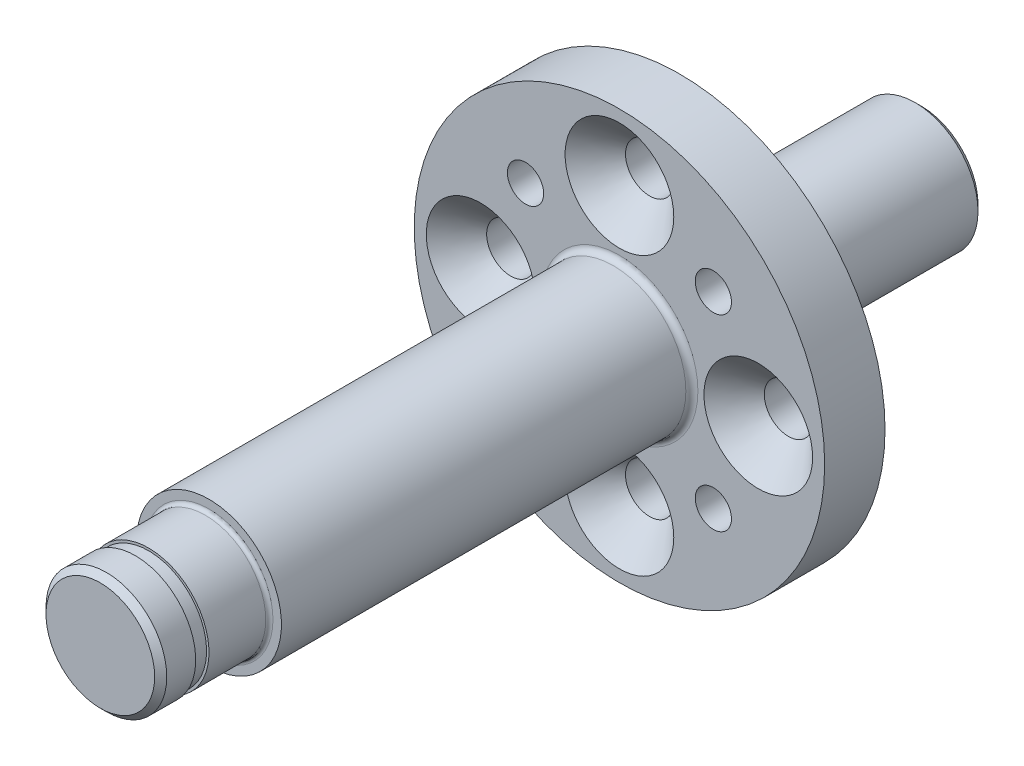
ISO-10303-21;
HEADER;
FILE_DESCRIPTION(('STEP AP214'),'2;1');
FILE_NAME('part.step','',(''),(''),'','','');
FILE_SCHEMA(('AUTOMOTIVE_DESIGN { 1 0 10303 214 1 1 1 1 }'));
ENDSEC;
DATA;
#1=APPLICATION_CONTEXT('core data for automotive mechanical design processes');
#2=APPLICATION_PROTOCOL_DEFINITION('international standard','automotive_design',2000,#1);
#3=PRODUCT_CONTEXT('',#1,'mechanical');
#4=PRODUCT('Part','Part','',(#3));
#5=PRODUCT_RELATED_PRODUCT_CATEGORY('part','',(#4));
#6=PRODUCT_DEFINITION_FORMATION('','',#4);
#7=PRODUCT_DEFINITION_CONTEXT('part definition',#1,'design');
#8=PRODUCT_DEFINITION('design','',#6,#7);
#9=PRODUCT_DEFINITION_SHAPE('','',#8);
#10=(LENGTH_UNIT() NAMED_UNIT(*) SI_UNIT(.MILLI.,.METRE.));
#11=(NAMED_UNIT(*) PLANE_ANGLE_UNIT() SI_UNIT($,.RADIAN.));
#12=(NAMED_UNIT(*) SI_UNIT($,.STERADIAN.) SOLID_ANGLE_UNIT());
#13=UNCERTAINTY_MEASURE_WITH_UNIT(LENGTH_MEASURE(1.E-05),#10,'distance_accuracy_value','');
#14=(GEOMETRIC_REPRESENTATION_CONTEXT(3) GLOBAL_UNCERTAINTY_ASSIGNED_CONTEXT((#13)) GLOBAL_UNIT_ASSIGNED_CONTEXT((#10,
#11,#12)) REPRESENTATION_CONTEXT('',''));
#15=CARTESIAN_POINT('',(0.,0.,0.));
#16=DIRECTION('',(0.,0.,1.));
#17=DIRECTION('',(1.,0.,0.));
#18=AXIS2_PLACEMENT_3D('',#15,#16,#17);
#19=CARTESIAN_POINT('',(0.,0.,5.));
#20=DIRECTION('',(0.,0.,-1.));
#21=DIRECTION('',(-1.,0.,0.));
#22=AXIS2_PLACEMENT_3D('',#19,#20,#21);
#23=CYLINDRICAL_SURFACE('',#22,17.);
#24=CARTESIAN_POINT('',(0.,0.,5.));
#25=DIRECTION('',(0.,0.,1.));
#26=DIRECTION('',(1.,0.,0.));
#27=AXIS2_PLACEMENT_3D('',#24,#25,#26);
#28=CIRCLE('',#27,17.);
#29=CARTESIAN_POINT('',(17.,0.,5.));
#30=VERTEX_POINT('',#29);
#31=EDGE_CURVE('E70',#30,#30,#28,.T.);
#32=ORIENTED_EDGE('',*,*,#31,.F.);
#33=EDGE_LOOP('',(#32));
#34=FACE_BOUND('',#33,.T.);
#35=CARTESIAN_POINT('',(0.,0.,0.));
#36=DIRECTION('',(0.,0.,1.));
#37=DIRECTION('',(1.,0.,0.));
#38=AXIS2_PLACEMENT_3D('',#35,#36,#37);
#39=CIRCLE('',#38,17.);
#40=CARTESIAN_POINT('',(17.,0.,0.));
#41=VERTEX_POINT('',#40);
#42=EDGE_CURVE('E89',#41,#41,#39,.T.);
#43=ORIENTED_EDGE('',*,*,#42,.T.);
#44=EDGE_LOOP('',(#43));
#45=FACE_BOUND('',#44,.T.);
#46=ADVANCED_FACE('F32',(#34,#45),#23,.T.);
#47=CARTESIAN_POINT('',(0.,0.,5.));
#48=DIRECTION('',(0.,0.,1.));
#49=DIRECTION('',(1.,0.,0.));
#50=AXIS2_PLACEMENT_3D('',#47,#48,#49);
#51=PLANE('',#50);
#52=CARTESIAN_POINT('',(0.,0.,5.));
#53=DIRECTION('',(0.,0.,1.));
#54=DIRECTION('',(1.,0.,0.));
#55=AXIS2_PLACEMENT_3D('',#52,#53,#54);
#56=CIRCLE('',#55,6.5);
#57=CARTESIAN_POINT('',(6.5,0.,5.));
#58=VERTEX_POINT('',#57);
#59=EDGE_CURVE('E39',#58,#58,#56,.F.);
#60=ORIENTED_EDGE('',*,*,#59,.T.);
#61=EDGE_LOOP('',(#60));
#62=FACE_BOUND('',#61,.T.);
#63=CARTESIAN_POINT('',(7.77817459305201,7.77817459305204,5.));
#64=DIRECTION('',(0.,0.,1.));
#65=DIRECTION('',(1.,0.,0.));
#66=AXIS2_PLACEMENT_3D('',#63,#64,#65);
#67=CIRCLE('',#66,1.5);
#68=CARTESIAN_POINT('',(9.278174593052,7.77817459305204,5.));
#69=VERTEX_POINT('',#68);
#70=EDGE_CURVE('E133',#69,#69,#67,.T.);
#71=ORIENTED_EDGE('',*,*,#70,.F.);
#72=EDGE_LOOP('',(#71));
#73=FACE_BOUND('',#72,.T.);
#74=CARTESIAN_POINT('',(-7.77817459305201,-7.77817459305203,5.));
#75=DIRECTION('',(0.,0.,1.));
#76=DIRECTION('',(1.,0.,0.));
#77=AXIS2_PLACEMENT_3D('',#74,#75,#76);
#78=CIRCLE('',#77,1.5);
#79=CARTESIAN_POINT('',(-6.27817459305201,-7.77817459305203,5.));
#80=VERTEX_POINT('',#79);
#81=EDGE_CURVE('E127',#80,#80,#78,.T.);
#82=ORIENTED_EDGE('',*,*,#81,.F.);
#83=EDGE_LOOP('',(#82));
#84=FACE_BOUND('',#83,.T.);
#85=CARTESIAN_POINT('',(-7.77817459305204,7.77817459305201,5.));
#86=DIRECTION('',(0.,0.,1.));
#87=DIRECTION('',(1.,0.,0.));
#88=AXIS2_PLACEMENT_3D('',#85,#86,#87);
#89=CIRCLE('',#88,1.5);
#90=CARTESIAN_POINT('',(-6.27817459305204,7.77817459305201,5.));
#91=VERTEX_POINT('',#90);
#92=EDGE_CURVE('E121',#91,#91,#89,.T.);
#93=ORIENTED_EDGE('',*,*,#92,.F.);
#94=EDGE_LOOP('',(#93));
#95=FACE_BOUND('',#94,.T.);
#96=CARTESIAN_POINT('',(7.77817459305204,-7.77817459305201,5.));
#97=DIRECTION('',(0.,0.,1.));
#98=DIRECTION('',(1.,0.,0.));
#99=AXIS2_PLACEMENT_3D('',#96,#97,#98);
#100=CIRCLE('',#99,1.5);
#101=CARTESIAN_POINT('',(9.27817459305203,-7.77817459305201,5.));
#102=VERTEX_POINT('',#101);
#103=EDGE_CURVE('E115',#102,#102,#100,.T.);
#104=ORIENTED_EDGE('',*,*,#103,.F.);
#105=EDGE_LOOP('',(#104));
#106=FACE_BOUND('',#105,.T.);
#107=CARTESIAN_POINT('',(0.,11.5,5.));
#108=DIRECTION('',(0.,0.,1.));
#109=DIRECTION('',(1.,0.,0.));
#110=AXIS2_PLACEMENT_3D('',#107,#108,#109);
#111=CIRCLE('',#110,4.5);
#112=CARTESIAN_POINT('',(4.5,11.5,5.));
#113=VERTEX_POINT('',#112);
#114=EDGE_CURVE('E109',#113,#113,#111,.T.);
#115=ORIENTED_EDGE('',*,*,#114,.F.);
#116=EDGE_LOOP('',(#115));
#117=FACE_BOUND('',#116,.T.);
#118=CARTESIAN_POINT('',(11.5,0.,5.));
#119=DIRECTION('',(0.,0.,1.));
#120=DIRECTION('',(1.,0.,0.));
#121=AXIS2_PLACEMENT_3D('',#118,#119,#120);
#122=CIRCLE('',#121,4.5);
#123=CARTESIAN_POINT('',(16.,0.,5.));
#124=VERTEX_POINT('',#123);
#125=EDGE_CURVE('E74',#124,#124,#122,.T.);
#126=ORIENTED_EDGE('',*,*,#125,.F.);
#127=EDGE_LOOP('',(#126));
#128=FACE_BOUND('',#127,.T.);
#129=CARTESIAN_POINT('',(0.,-11.5,5.));
#130=DIRECTION('',(0.,0.,1.));
#131=DIRECTION('',(1.,0.,0.));
#132=AXIS2_PLACEMENT_3D('',#129,#130,#131);
#133=CIRCLE('',#132,4.5);
#134=CARTESIAN_POINT('',(4.5,-11.5,5.));
#135=VERTEX_POINT('',#134);
#136=EDGE_CURVE('E79',#135,#135,#133,.T.);
#137=ORIENTED_EDGE('',*,*,#136,.F.);
#138=EDGE_LOOP('',(#137));
#139=FACE_BOUND('',#138,.T.);
#140=CARTESIAN_POINT('',(-11.5,0.,5.));
#141=DIRECTION('',(0.,0.,1.));
#142=DIRECTION('',(1.,0.,0.));
#143=AXIS2_PLACEMENT_3D('',#140,#141,#142);
#144=CIRCLE('',#143,4.5);
#145=CARTESIAN_POINT('',(-7.,0.,5.));
#146=VERTEX_POINT('',#145);
#147=EDGE_CURVE('E84',#146,#146,#144,.T.);
#148=ORIENTED_EDGE('',*,*,#147,.F.);
#149=EDGE_LOOP('',(#148));
#150=FACE_BOUND('',#149,.T.);
#151=ORIENTED_EDGE('',*,*,#31,.T.);
#152=EDGE_LOOP('',(#151));
#153=FACE_BOUND('',#152,.T.);
#154=ADVANCED_FACE('F170',(#62,#73,#84,#95,#106,#117,#128,#139,#150,#153),#51,.T.);
#155=CARTESIAN_POINT('',(0.,0.,0.));
#156=DIRECTION('',(0.,0.,1.));
#157=DIRECTION('',(1.,0.,0.));
#158=AXIS2_PLACEMENT_3D('',#155,#156,#157);
#159=PLANE('',#158);
#160=CARTESIAN_POINT('',(0.,0.,0.));
#161=DIRECTION('',(0.,0.,1.));
#162=DIRECTION('',(1.,0.,0.));
#163=AXIS2_PLACEMENT_3D('',#160,#161,#162);
#164=CIRCLE('',#163,5.7);
#165=CARTESIAN_POINT('',(5.7,0.,0.));
#166=VERTEX_POINT('',#165);
#167=EDGE_CURVE('E43',#166,#166,#164,.T.);
#168=ORIENTED_EDGE('',*,*,#167,.T.);
#169=EDGE_LOOP('',(#168));
#170=FACE_BOUND('',#169,.T.);
#171=CARTESIAN_POINT('',(7.77817459305201,7.77817459305204,0.));
#172=DIRECTION('',(0.,0.,1.));
#173=DIRECTION('',(1.,0.,0.));
#174=AXIS2_PLACEMENT_3D('',#171,#172,#173);
#175=CIRCLE('',#174,1.5);
#176=CARTESIAN_POINT('',(9.278174593052,7.77817459305204,0.));
#177=VERTEX_POINT('',#176);
#178=EDGE_CURVE('E130',#177,#177,#175,.T.);
#179=ORIENTED_EDGE('',*,*,#178,.T.);
#180=EDGE_LOOP('',(#179));
#181=FACE_BOUND('',#180,.T.);
#182=CARTESIAN_POINT('',(-7.77817459305201,-7.77817459305203,0.));
#183=DIRECTION('',(0.,0.,1.));
#184=DIRECTION('',(1.,0.,0.));
#185=AXIS2_PLACEMENT_3D('',#182,#183,#184);
#186=CIRCLE('',#185,1.5);
#187=CARTESIAN_POINT('',(-6.27817459305201,-7.77817459305203,0.));
#188=VERTEX_POINT('',#187);
#189=EDGE_CURVE('E124',#188,#188,#186,.T.);
#190=ORIENTED_EDGE('',*,*,#189,.T.);
#191=EDGE_LOOP('',(#190));
#192=FACE_BOUND('',#191,.T.);
#193=CARTESIAN_POINT('',(-7.77817459305204,7.77817459305201,0.));
#194=DIRECTION('',(0.,0.,1.));
#195=DIRECTION('',(1.,0.,0.));
#196=AXIS2_PLACEMENT_3D('',#193,#194,#195);
#197=CIRCLE('',#196,1.5);
#198=CARTESIAN_POINT('',(-6.27817459305204,7.77817459305201,0.));
#199=VERTEX_POINT('',#198);
#200=EDGE_CURVE('E118',#199,#199,#197,.T.);
#201=ORIENTED_EDGE('',*,*,#200,.T.);
#202=EDGE_LOOP('',(#201));
#203=FACE_BOUND('',#202,.T.);
#204=CARTESIAN_POINT('',(7.77817459305204,-7.77817459305201,0.));
#205=DIRECTION('',(0.,0.,1.));
#206=DIRECTION('',(1.,0.,0.));
#207=AXIS2_PLACEMENT_3D('',#204,#205,#206);
#208=CIRCLE('',#207,1.5);
#209=CARTESIAN_POINT('',(9.27817459305203,-7.77817459305201,0.));
#210=VERTEX_POINT('',#209);
#211=EDGE_CURVE('E112',#210,#210,#208,.T.);
#212=ORIENTED_EDGE('',*,*,#211,.T.);
#213=EDGE_LOOP('',(#212));
#214=FACE_BOUND('',#213,.T.);
#215=CARTESIAN_POINT('',(0.,11.5,0.));
#216=DIRECTION('',(0.,0.,1.));
#217=DIRECTION('',(1.,0.,0.));
#218=AXIS2_PLACEMENT_3D('',#215,#216,#217);
#219=CIRCLE('',#218,2.);
#220=CARTESIAN_POINT('',(2.,11.5,0.));
#221=VERTEX_POINT('',#220);
#222=EDGE_CURVE('E71',#221,#221,#219,.T.);
#223=ORIENTED_EDGE('',*,*,#222,.T.);
#224=EDGE_LOOP('',(#223));
#225=FACE_BOUND('',#224,.T.);
#226=CARTESIAN_POINT('',(11.5,0.,0.));
#227=DIRECTION('',(0.,0.,1.));
#228=DIRECTION('',(1.,0.,0.));
#229=AXIS2_PLACEMENT_3D('',#226,#227,#228);
#230=CIRCLE('',#229,2.);
#231=CARTESIAN_POINT('',(13.5,0.,0.));
#232=VERTEX_POINT('',#231);
#233=EDGE_CURVE('E76',#232,#232,#230,.T.);
#234=ORIENTED_EDGE('',*,*,#233,.T.);
#235=EDGE_LOOP('',(#234));
#236=FACE_BOUND('',#235,.T.);
#237=CARTESIAN_POINT('',(0.,-11.5,0.));
#238=DIRECTION('',(0.,0.,1.));
#239=DIRECTION('',(1.,0.,0.));
#240=AXIS2_PLACEMENT_3D('',#237,#238,#239);
#241=CIRCLE('',#240,2.);
#242=CARTESIAN_POINT('',(2.,-11.5,0.));
#243=VERTEX_POINT('',#242);
#244=EDGE_CURVE('E81',#243,#243,#241,.T.);
#245=ORIENTED_EDGE('',*,*,#244,.T.);
#246=EDGE_LOOP('',(#245));
#247=FACE_BOUND('',#246,.T.);
#248=CARTESIAN_POINT('',(-11.5,0.,0.));
#249=DIRECTION('',(0.,0.,1.));
#250=DIRECTION('',(1.,0.,0.));
#251=AXIS2_PLACEMENT_3D('',#248,#249,#250);
#252=CIRCLE('',#251,2.);
#253=CARTESIAN_POINT('',(-9.5,0.,0.));
#254=VERTEX_POINT('',#253);
#255=EDGE_CURVE('E86',#254,#254,#252,.T.);
#256=ORIENTED_EDGE('',*,*,#255,.T.);
#257=EDGE_LOOP('',(#256));
#258=FACE_BOUND('',#257,.T.);
#259=ORIENTED_EDGE('',*,*,#42,.F.);
#260=EDGE_LOOP('',(#259));
#261=FACE_BOUND('',#260,.T.);
#262=ADVANCED_FACE('F176',(#170,#181,#192,#203,#214,#225,#236,#247,#258,#261),#159,.F.);
#263=CARTESIAN_POINT('',(0.,0.,-20.));
#264=DIRECTION('',(0.,0.,1.));
#265=DIRECTION('',(1.,0.,0.));
#266=AXIS2_PLACEMENT_3D('',#263,#264,#265);
#267=CYLINDRICAL_SURFACE('',#266,5.2);
#268=CARTESIAN_POINT('',(0.,0.,-0.5));
#269=DIRECTION('',(0.,0.,1.));
#270=DIRECTION('',(1.,0.,0.));
#271=AXIS2_PLACEMENT_3D('',#268,#269,#270);
#272=CIRCLE('',#271,5.2);
#273=CARTESIAN_POINT('',(5.2,0.,-0.5));
#274=VERTEX_POINT('',#273);
#275=EDGE_CURVE('E47',#274,#274,#272,.F.);
#276=ORIENTED_EDGE('',*,*,#275,.T.);
#277=EDGE_LOOP('',(#276));
#278=FACE_BOUND('',#277,.T.);
#279=CARTESIAN_POINT('',(0.,0.,-19.5));
#280=DIRECTION('',(0.,0.,-1.));
#281=DIRECTION('',(-1.,0.,0.));
#282=AXIS2_PLACEMENT_3D('',#279,#280,#281);
#283=CIRCLE('',#282,5.2);
#284=CARTESIAN_POINT('',(-5.2,0.,-19.5));
#285=VERTEX_POINT('',#284);
#286=EDGE_CURVE('E64',#285,#285,#283,.F.);
#287=ORIENTED_EDGE('',*,*,#286,.T.);
#288=EDGE_LOOP('',(#287));
#289=FACE_BOUND('',#288,.T.);
#290=ADVANCED_FACE('F203',(#278,#289),#267,.T.);
#291=CARTESIAN_POINT('',(0.,0.,-20.));
#292=DIRECTION('',(0.,0.,-1.));
#293=DIRECTION('',(-1.,0.,0.));
#294=AXIS2_PLACEMENT_3D('',#291,#292,#293);
#295=PLANE('',#294);
#296=CARTESIAN_POINT('',(0.,0.,-20.));
#297=DIRECTION('',(0.,0.,-1.));
#298=DIRECTION('',(-1.,0.,0.));
#299=AXIS2_PLACEMENT_3D('',#296,#297,#298);
#300=CIRCLE('',#299,4.70000000000001);
#301=CARTESIAN_POINT('',(-4.70000000000001,0.,-20.));
#302=VERTEX_POINT('',#301);
#303=EDGE_CURVE('E67',#302,#302,#300,.T.);
#304=ORIENTED_EDGE('',*,*,#303,.T.);
#305=EDGE_LOOP('',(#304));
#306=FACE_BOUND('',#305,.T.);
#307=ADVANCED_FACE('F206',(#306),#295,.T.);
#308=CARTESIAN_POINT('',(-11.5,0.,5.));
#309=DIRECTION('',(0.,0.,1.));
#310=DIRECTION('',(1.,0.,0.));
#311=AXIS2_PLACEMENT_3D('',#308,#309,#310);
#312=CYLINDRICAL_SURFACE('',#311,2.);
#313=CARTESIAN_POINT('',(-11.5,0.,2.5));
#314=DIRECTION('',(0.,0.,1.));
#315=DIRECTION('',(1.,0.,0.));
#316=AXIS2_PLACEMENT_3D('',#313,#314,#315);
#317=CIRCLE('',#316,2.);
#318=CARTESIAN_POINT('',(-9.5,0.,2.5));
#319=VERTEX_POINT('',#318);
#320=EDGE_CURVE('E90',#319,#319,#317,.T.);
#321=ORIENTED_EDGE('',*,*,#320,.T.);
#322=EDGE_LOOP('',(#321));
#323=FACE_BOUND('',#322,.T.);
#324=ORIENTED_EDGE('',*,*,#255,.F.);
#325=EDGE_LOOP('',(#324));
#326=FACE_BOUND('',#325,.T.);
#327=ADVANCED_FACE('F213',(#323,#326),#312,.F.);
#328=CARTESIAN_POINT('',(-11.5,0.,5.));
#329=DIRECTION('',(0.,0.,1.));
#330=DIRECTION('',(1.,0.,0.));
#331=AXIS2_PLACEMENT_3D('',#328,#329,#330);
#332=CONICAL_SURFACE('',#331,4.5,0.785398163397448);
#333=ORIENTED_EDGE('',*,*,#320,.F.);
#334=EDGE_LOOP('',(#333));
#335=FACE_BOUND('',#334,.T.);
#336=ORIENTED_EDGE('',*,*,#147,.T.);
#337=EDGE_LOOP('',(#336));
#338=FACE_BOUND('',#337,.T.);
#339=ADVANCED_FACE('F218',(#335,#338),#332,.F.);
#340=CARTESIAN_POINT('',(0.,-11.5,5.));
#341=DIRECTION('',(0.,0.,1.));
#342=DIRECTION('',(1.,0.,0.));
#343=AXIS2_PLACEMENT_3D('',#340,#341,#342);
#344=CYLINDRICAL_SURFACE('',#343,2.);
#345=CARTESIAN_POINT('',(0.,-11.5,2.5));
#346=DIRECTION('',(0.,0.,1.));
#347=DIRECTION('',(1.,0.,0.));
#348=AXIS2_PLACEMENT_3D('',#345,#346,#347);
#349=CIRCLE('',#348,2.);
#350=CARTESIAN_POINT('',(2.,-11.5,2.5));
#351=VERTEX_POINT('',#350);
#352=EDGE_CURVE('E85',#351,#351,#349,.T.);
#353=ORIENTED_EDGE('',*,*,#352,.T.);
#354=EDGE_LOOP('',(#353));
#355=FACE_BOUND('',#354,.T.);
#356=ORIENTED_EDGE('',*,*,#244,.F.);
#357=EDGE_LOOP('',(#356));
#358=FACE_BOUND('',#357,.T.);
#359=ADVANCED_FACE('F224',(#355,#358),#344,.F.);
#360=CARTESIAN_POINT('',(0.,-11.5,5.));
#361=DIRECTION('',(0.,0.,1.));
#362=DIRECTION('',(1.,0.,0.));
#363=AXIS2_PLACEMENT_3D('',#360,#361,#362);
#364=CONICAL_SURFACE('',#363,4.5,0.785398163397448);
#365=ORIENTED_EDGE('',*,*,#352,.F.);
#366=EDGE_LOOP('',(#365));
#367=FACE_BOUND('',#366,.T.);
#368=ORIENTED_EDGE('',*,*,#136,.T.);
#369=EDGE_LOOP('',(#368));
#370=FACE_BOUND('',#369,.T.);
#371=ADVANCED_FACE('F228',(#367,#370),#364,.F.);
#372=CARTESIAN_POINT('',(11.5,0.,5.));
#373=DIRECTION('',(0.,0.,1.));
#374=DIRECTION('',(1.,0.,0.));
#375=AXIS2_PLACEMENT_3D('',#372,#373,#374);
#376=CYLINDRICAL_SURFACE('',#375,2.);
#377=CARTESIAN_POINT('',(11.5,0.,2.5));
#378=DIRECTION('',(0.,0.,1.));
#379=DIRECTION('',(1.,0.,0.));
#380=AXIS2_PLACEMENT_3D('',#377,#378,#379);
#381=CIRCLE('',#380,2.);
#382=CARTESIAN_POINT('',(13.5,0.,2.5));
#383=VERTEX_POINT('',#382);
#384=EDGE_CURVE('E80',#383,#383,#381,.T.);
#385=ORIENTED_EDGE('',*,*,#384,.T.);
#386=EDGE_LOOP('',(#385));
#387=FACE_BOUND('',#386,.T.);
#388=ORIENTED_EDGE('',*,*,#233,.F.);
#389=EDGE_LOOP('',(#388));
#390=FACE_BOUND('',#389,.T.);
#391=ADVANCED_FACE('F232',(#387,#390),#376,.F.);
#392=CARTESIAN_POINT('',(11.5,0.,5.));
#393=DIRECTION('',(0.,0.,1.));
#394=DIRECTION('',(1.,0.,0.));
#395=AXIS2_PLACEMENT_3D('',#392,#393,#394);
#396=CONICAL_SURFACE('',#395,4.5,0.785398163397448);
#397=ORIENTED_EDGE('',*,*,#384,.F.);
#398=EDGE_LOOP('',(#397));
#399=FACE_BOUND('',#398,.T.);
#400=ORIENTED_EDGE('',*,*,#125,.T.);
#401=EDGE_LOOP('',(#400));
#402=FACE_BOUND('',#401,.T.);
#403=ADVANCED_FACE('F236',(#399,#402),#396,.F.);
#404=CARTESIAN_POINT('',(0.,11.5,5.));
#405=DIRECTION('',(0.,0.,1.));
#406=DIRECTION('',(1.,0.,0.));
#407=AXIS2_PLACEMENT_3D('',#404,#405,#406);
#408=CYLINDRICAL_SURFACE('',#407,2.);
#409=CARTESIAN_POINT('',(0.,11.5,2.5));
#410=DIRECTION('',(0.,0.,1.));
#411=DIRECTION('',(1.,0.,0.));
#412=AXIS2_PLACEMENT_3D('',#409,#410,#411);
#413=CIRCLE('',#412,2.);
#414=CARTESIAN_POINT('',(2.,11.5,2.5));
#415=VERTEX_POINT('',#414);
#416=EDGE_CURVE('E75',#415,#415,#413,.T.);
#417=ORIENTED_EDGE('',*,*,#416,.T.);
#418=EDGE_LOOP('',(#417));
#419=FACE_BOUND('',#418,.T.);
#420=ORIENTED_EDGE('',*,*,#222,.F.);
#421=EDGE_LOOP('',(#420));
#422=FACE_BOUND('',#421,.T.);
#423=ADVANCED_FACE('F240',(#419,#422),#408,.F.);
#424=CARTESIAN_POINT('',(0.,11.5,5.));
#425=DIRECTION('',(0.,0.,1.));
#426=DIRECTION('',(1.,0.,0.));
#427=AXIS2_PLACEMENT_3D('',#424,#425,#426);
#428=CONICAL_SURFACE('',#427,4.5,0.785398163397448);
#429=ORIENTED_EDGE('',*,*,#416,.F.);
#430=EDGE_LOOP('',(#429));
#431=FACE_BOUND('',#430,.T.);
#432=ORIENTED_EDGE('',*,*,#114,.T.);
#433=EDGE_LOOP('',(#432));
#434=FACE_BOUND('',#433,.T.);
#435=ADVANCED_FACE('F244',(#431,#434),#428,.F.);
#436=CARTESIAN_POINT('',(7.77817459305204,-7.77817459305201,5.));
#437=DIRECTION('',(0.,0.,1.));
#438=DIRECTION('',(1.,0.,0.));
#439=AXIS2_PLACEMENT_3D('',#436,#437,#438);
#440=CYLINDRICAL_SURFACE('',#439,1.5);
#441=ORIENTED_EDGE('',*,*,#103,.T.);
#442=EDGE_LOOP('',(#441));
#443=FACE_BOUND('',#442,.T.);
#444=ORIENTED_EDGE('',*,*,#211,.F.);
#445=EDGE_LOOP('',(#444));
#446=FACE_BOUND('',#445,.T.);
#447=ADVANCED_FACE('F248',(#443,#446),#440,.F.);
#448=CARTESIAN_POINT('',(-7.77817459305204,7.77817459305201,5.));
#449=DIRECTION('',(0.,0.,1.));
#450=DIRECTION('',(1.,0.,0.));
#451=AXIS2_PLACEMENT_3D('',#448,#449,#450);
#452=CYLINDRICAL_SURFACE('',#451,1.5);
#453=ORIENTED_EDGE('',*,*,#92,.T.);
#454=EDGE_LOOP('',(#453));
#455=FACE_BOUND('',#454,.T.);
#456=ORIENTED_EDGE('',*,*,#200,.F.);
#457=EDGE_LOOP('',(#456));
#458=FACE_BOUND('',#457,.T.);
#459=ADVANCED_FACE('F252',(#455,#458),#452,.F.);
#460=CARTESIAN_POINT('',(-7.77817459305201,-7.77817459305203,5.));
#461=DIRECTION('',(0.,0.,1.));
#462=DIRECTION('',(1.,0.,0.));
#463=AXIS2_PLACEMENT_3D('',#460,#461,#462);
#464=CYLINDRICAL_SURFACE('',#463,1.5);
#465=ORIENTED_EDGE('',*,*,#81,.T.);
#466=EDGE_LOOP('',(#465));
#467=FACE_BOUND('',#466,.T.);
#468=ORIENTED_EDGE('',*,*,#189,.F.);
#469=EDGE_LOOP('',(#468));
#470=FACE_BOUND('',#469,.T.);
#471=ADVANCED_FACE('F256',(#467,#470),#464,.F.);
#472=CARTESIAN_POINT('',(7.77817459305201,7.77817459305204,5.));
#473=DIRECTION('',(0.,0.,1.));
#474=DIRECTION('',(1.,0.,0.));
#475=AXIS2_PLACEMENT_3D('',#472,#473,#474);
#476=CYLINDRICAL_SURFACE('',#475,1.5);
#477=ORIENTED_EDGE('',*,*,#70,.T.);
#478=EDGE_LOOP('',(#477));
#479=FACE_BOUND('',#478,.T.);
#480=ORIENTED_EDGE('',*,*,#178,.F.);
#481=EDGE_LOOP('',(#480));
#482=FACE_BOUND('',#481,.T.);
#483=ADVANCED_FACE('F260',(#479,#482),#476,.F.);
#484=CARTESIAN_POINT('',(0.,0.,-20.));
#485=DIRECTION('',(0.,0.,-1.));
#486=DIRECTION('',(-1.,0.,0.));
#487=AXIS2_PLACEMENT_3D('',#484,#485,#486);
#488=CYLINDRICAL_SURFACE('',#487,6.);
#489=CARTESIAN_POINT('',(0.,0.,5.5));
#490=DIRECTION('',(0.,0.,1.));
#491=DIRECTION('',(1.,0.,0.));
#492=AXIS2_PLACEMENT_3D('',#489,#490,#491);
#493=CIRCLE('',#492,6.);
#494=CARTESIAN_POINT('',(6.,0.,5.5));
#495=VERTEX_POINT('',#494);
#496=EDGE_CURVE('E10',#495,#495,#493,.T.);
#497=ORIENTED_EDGE('',*,*,#496,.T.);
#498=EDGE_LOOP('',(#497));
#499=FACE_BOUND('',#498,.T.);
#500=CARTESIAN_POINT('',(0.,0.,39.));
#501=DIRECTION('',(0.,0.,-1.));
#502=DIRECTION('',(-1.,0.,0.));
#503=AXIS2_PLACEMENT_3D('',#500,#501,#502);
#504=CIRCLE('',#503,6.);
#505=CARTESIAN_POINT('',(-6.,0.,39.));
#506=VERTEX_POINT('',#505);
#507=EDGE_CURVE('E136',#506,#506,#504,.T.);
#508=ORIENTED_EDGE('',*,*,#507,.T.);
#509=EDGE_LOOP('',(#508));
#510=FACE_BOUND('',#509,.T.);
#511=ADVANCED_FACE('F264',(#499,#510),#488,.T.);
#512=CARTESIAN_POINT('',(0.,6.,39.));
#513=DIRECTION('',(0.,0.,1.));
#514=DIRECTION('',(1.,0.,0.));
#515=AXIS2_PLACEMENT_3D('',#512,#513,#514);
#516=PLANE('',#515);
#517=CARTESIAN_POINT('',(0.,0.,39.));
#518=DIRECTION('',(0.,0.,1.));
#519=DIRECTION('',(1.,0.,0.));
#520=AXIS2_PLACEMENT_3D('',#517,#518,#519);
#521=CIRCLE('',#520,5.3);
#522=CARTESIAN_POINT('',(5.3,0.,39.));
#523=VERTEX_POINT('',#522);
#524=EDGE_CURVE('E55',#523,#523,#521,.F.);
#525=ORIENTED_EDGE('',*,*,#524,.T.);
#526=EDGE_LOOP('',(#525));
#527=FACE_BOUND('',#526,.T.);
#528=ORIENTED_EDGE('',*,*,#507,.F.);
#529=EDGE_LOOP('',(#528));
#530=FACE_BOUND('',#529,.T.);
#531=ADVANCED_FACE('F268',(#527,#530),#516,.T.);
#532=CARTESIAN_POINT('',(0.,0.,-20.));
#533=DIRECTION('',(0.,0.,-1.));
#534=DIRECTION('',(-1.,0.,0.));
#535=AXIS2_PLACEMENT_3D('',#532,#533,#534);
#536=CYLINDRICAL_SURFACE('',#535,5.);
#537=CARTESIAN_POINT('',(0.,0.,39.3));
#538=DIRECTION('',(0.,0.,1.));
#539=DIRECTION('',(1.,0.,0.));
#540=AXIS2_PLACEMENT_3D('',#537,#538,#539);
#541=CIRCLE('',#540,5.);
#542=CARTESIAN_POINT('',(5.,0.,39.3));
#543=VERTEX_POINT('',#542);
#544=EDGE_CURVE('E52',#543,#543,#541,.T.);
#545=ORIENTED_EDGE('',*,*,#544,.T.);
#546=EDGE_LOOP('',(#545));
#547=FACE_BOUND('',#546,.T.);
#548=CARTESIAN_POINT('',(0.,0.,44.));
#549=DIRECTION('',(0.,0.,-1.));
#550=DIRECTION('',(-1.,0.,0.));
#551=AXIS2_PLACEMENT_3D('',#548,#549,#550);
#552=CIRCLE('',#551,5.);
#553=CARTESIAN_POINT('',(-5.,0.,44.));
#554=VERTEX_POINT('',#553);
#555=EDGE_CURVE('E139',#554,#554,#552,.T.);
#556=ORIENTED_EDGE('',*,*,#555,.T.);
#557=EDGE_LOOP('',(#556));
#558=FACE_BOUND('',#557,.T.);
#559=ADVANCED_FACE('F271',(#547,#558),#536,.T.);
#560=CARTESIAN_POINT('',(0.,5.,44.));
#561=DIRECTION('',(0.,0.,1.));
#562=DIRECTION('',(1.,0.,0.));
#563=AXIS2_PLACEMENT_3D('',#560,#561,#562);
#564=PLANE('',#563);
#565=CARTESIAN_POINT('',(0.,0.,44.));
#566=DIRECTION('',(0.,0.,-1.));
#567=DIRECTION('',(-1.,0.,0.));
#568=AXIS2_PLACEMENT_3D('',#565,#566,#567);
#569=CIRCLE('',#568,4.8);
#570=CARTESIAN_POINT('',(-4.8,0.,44.));
#571=VERTEX_POINT('',#570);
#572=EDGE_CURVE('E142',#571,#571,#569,.T.);
#573=ORIENTED_EDGE('',*,*,#572,.T.);
#574=EDGE_LOOP('',(#573));
#575=FACE_BOUND('',#574,.T.);
#576=ORIENTED_EDGE('',*,*,#555,.F.);
#577=EDGE_LOOP('',(#576));
#578=FACE_BOUND('',#577,.T.);
#579=ADVANCED_FACE('F275',(#575,#578),#564,.T.);
#580=CARTESIAN_POINT('',(0.,0.,-20.));
#581=DIRECTION('',(0.,0.,-1.));
#582=DIRECTION('',(-1.,0.,0.));
#583=AXIS2_PLACEMENT_3D('',#580,#581,#582);
#584=CYLINDRICAL_SURFACE('',#583,4.8);
#585=CARTESIAN_POINT('',(0.,0.,45.1));
#586=DIRECTION('',(0.,0.,-1.));
#587=DIRECTION('',(-1.,0.,0.));
#588=AXIS2_PLACEMENT_3D('',#585,#586,#587);
#589=CIRCLE('',#588,4.8);
#590=CARTESIAN_POINT('',(-4.8,0.,45.1));
#591=VERTEX_POINT('',#590);
#592=EDGE_CURVE('E145',#591,#591,#589,.T.);
#593=ORIENTED_EDGE('',*,*,#592,.T.);
#594=EDGE_LOOP('',(#593));
#595=FACE_BOUND('',#594,.T.);
#596=ORIENTED_EDGE('',*,*,#572,.F.);
#597=EDGE_LOOP('',(#596));
#598=FACE_BOUND('',#597,.T.);
#599=ADVANCED_FACE('F167',(#595,#598),#584,.T.);
#600=CARTESIAN_POINT('',(0.,4.8,45.1));
#601=DIRECTION('',(0.,0.,-1.));
#602=DIRECTION('',(-1.,0.,0.));
#603=AXIS2_PLACEMENT_3D('',#600,#601,#602);
#604=PLANE('',#603);
#605=CARTESIAN_POINT('',(0.,0.,45.1));
#606=DIRECTION('',(0.,0.,-1.));
#607=DIRECTION('',(-1.,0.,0.));
#608=AXIS2_PLACEMENT_3D('',#605,#606,#607);
#609=CIRCLE('',#608,5.);
#610=CARTESIAN_POINT('',(-5.,0.,45.1));
#611=VERTEX_POINT('',#610);
#612=EDGE_CURVE('E148',#611,#611,#609,.T.);
#613=ORIENTED_EDGE('',*,*,#612,.T.);
#614=EDGE_LOOP('',(#613));
#615=FACE_BOUND('',#614,.T.);
#616=ORIENTED_EDGE('',*,*,#592,.F.);
#617=EDGE_LOOP('',(#616));
#618=FACE_BOUND('',#617,.T.);
#619=ADVANCED_FACE('F152',(#615,#618),#604,.T.);
#620=CARTESIAN_POINT('',(0.,0.,-20.));
#621=DIRECTION('',(0.,0.,-1.));
#622=DIRECTION('',(-1.,0.,0.));
#623=AXIS2_PLACEMENT_3D('',#620,#621,#622);
#624=CYLINDRICAL_SURFACE('',#623,5.);
#625=CARTESIAN_POINT('',(0.,0.,47.5));
#626=DIRECTION('',(0.,0.,1.));
#627=DIRECTION('',(1.,0.,0.));
#628=AXIS2_PLACEMENT_3D('',#625,#626,#627);
#629=CIRCLE('',#628,5.);
#630=CARTESIAN_POINT('',(5.,0.,47.5));
#631=VERTEX_POINT('',#630);
#632=EDGE_CURVE('E61',#631,#631,#629,.F.);
#633=ORIENTED_EDGE('',*,*,#632,.T.);
#634=EDGE_LOOP('',(#633));
#635=FACE_BOUND('',#634,.T.);
#636=ORIENTED_EDGE('',*,*,#612,.F.);
#637=EDGE_LOOP('',(#636));
#638=FACE_BOUND('',#637,.T.);
#639=ADVANCED_FACE('F155',(#635,#638),#624,.T.);
#640=CARTESIAN_POINT('',(0.,5.,48.));
#641=DIRECTION('',(0.,0.,1.));
#642=DIRECTION('',(1.,0.,0.));
#643=AXIS2_PLACEMENT_3D('',#640,#641,#642);
#644=PLANE('',#643);
#645=CARTESIAN_POINT('',(0.,0.,48.));
#646=DIRECTION('',(0.,0.,1.));
#647=DIRECTION('',(1.,0.,0.));
#648=AXIS2_PLACEMENT_3D('',#645,#646,#647);
#649=CIRCLE('',#648,4.5);
#650=CARTESIAN_POINT('',(4.5,0.,48.));
#651=VERTEX_POINT('',#650);
#652=EDGE_CURVE('E58',#651,#651,#649,.T.);
#653=ORIENTED_EDGE('',*,*,#652,.T.);
#654=EDGE_LOOP('',(#653));
#655=FACE_BOUND('',#654,.T.);
#656=ADVANCED_FACE('F157',(#655),#644,.T.);
#657=CARTESIAN_POINT('',(0.,0.,-20.));
#658=DIRECTION('',(0.,0.,1.));
#659=DIRECTION('',(1.,0.,0.));
#660=AXIS2_PLACEMENT_3D('',#657,#658,#659);
#661=CONICAL_SURFACE('',#660,4.70000000000001,0.785398163397445);
#662=ORIENTED_EDGE('',*,*,#286,.F.);
#663=EDGE_LOOP('',(#662));
#664=FACE_BOUND('',#663,.T.);
#665=ORIENTED_EDGE('',*,*,#303,.F.);
#666=EDGE_LOOP('',(#665));
#667=FACE_BOUND('',#666,.T.);
#668=ADVANCED_FACE('F164',(#664,#667),#661,.T.);
#669=CARTESIAN_POINT('',(0.,0.,47.5));
#670=DIRECTION('',(0.,0.,-1.));
#671=DIRECTION('',(-1.,0.,0.));
#672=AXIS2_PLACEMENT_3D('',#669,#670,#671);
#673=CONICAL_SURFACE('',#672,5.,0.785398163397436);
#674=ORIENTED_EDGE('',*,*,#652,.F.);
#675=EDGE_LOOP('',(#674));
#676=FACE_BOUND('',#675,.T.);
#677=ORIENTED_EDGE('',*,*,#632,.F.);
#678=EDGE_LOOP('',(#677));
#679=FACE_BOUND('',#678,.T.);
#680=ADVANCED_FACE('F184',(#676,#679),#673,.T.);
#681=CARTESIAN_POINT('',(0.,0.,39.3));
#682=DIRECTION('',(0.,0.,1.));
#683=DIRECTION('',(1.,0.,0.));
#684=AXIS2_PLACEMENT_3D('',#681,#682,#683);
#685=TOROIDAL_SURFACE('',#684,5.3,0.3);
#686=ORIENTED_EDGE('',*,*,#544,.F.);
#687=EDGE_LOOP('',(#686));
#688=FACE_BOUND('',#687,.T.);
#689=ORIENTED_EDGE('',*,*,#524,.F.);
#690=EDGE_LOOP('',(#689));
#691=FACE_BOUND('',#690,.T.);
#692=ADVANCED_FACE('F188',(#688,#691),#685,.F.);
#693=CARTESIAN_POINT('',(0.,0.,-0.5));
#694=DIRECTION('',(0.,0.,1.));
#695=DIRECTION('',(1.,0.,0.));
#696=AXIS2_PLACEMENT_3D('',#693,#694,#695);
#697=TOROIDAL_SURFACE('',#696,5.7,0.5);
#698=ORIENTED_EDGE('',*,*,#167,.F.);
#699=EDGE_LOOP('',(#698));
#700=FACE_BOUND('',#699,.T.);
#701=ORIENTED_EDGE('',*,*,#275,.F.);
#702=EDGE_LOOP('',(#701));
#703=FACE_BOUND('',#702,.T.);
#704=ADVANCED_FACE('F191',(#700,#703),#697,.F.);
#705=CARTESIAN_POINT('',(0.,0.,5.5));
#706=DIRECTION('',(0.,0.,1.));
#707=DIRECTION('',(1.,0.,0.));
#708=AXIS2_PLACEMENT_3D('',#705,#706,#707);
#709=TOROIDAL_SURFACE('',#708,6.5,0.5);
#710=ORIENTED_EDGE('',*,*,#496,.F.);
#711=EDGE_LOOP('',(#710));
#712=FACE_BOUND('',#711,.T.);
#713=ORIENTED_EDGE('',*,*,#59,.F.);
#714=EDGE_LOOP('',(#713));
#715=FACE_BOUND('',#714,.T.);
#716=ADVANCED_FACE('F34',(#712,#715),#709,.F.);
#717=CLOSED_SHELL('',(#46,#154,#262,#290,#307,#327,#339,#359,#371,#391,#403,#423,#435,#447,#459,
#471,#483,#511,#531,#559,#579,#599,#619,#639,#656,#668,#680,#692,#704,#716));
#718=MANIFOLD_SOLID_BREP('B2',#717);
#719=ADVANCED_BREP_SHAPE_REPRESENTATION('',(#18,#718),#14);
#720=SHAPE_DEFINITION_REPRESENTATION(#9,#719);
ENDSEC;
END-ISO-10303-21;
